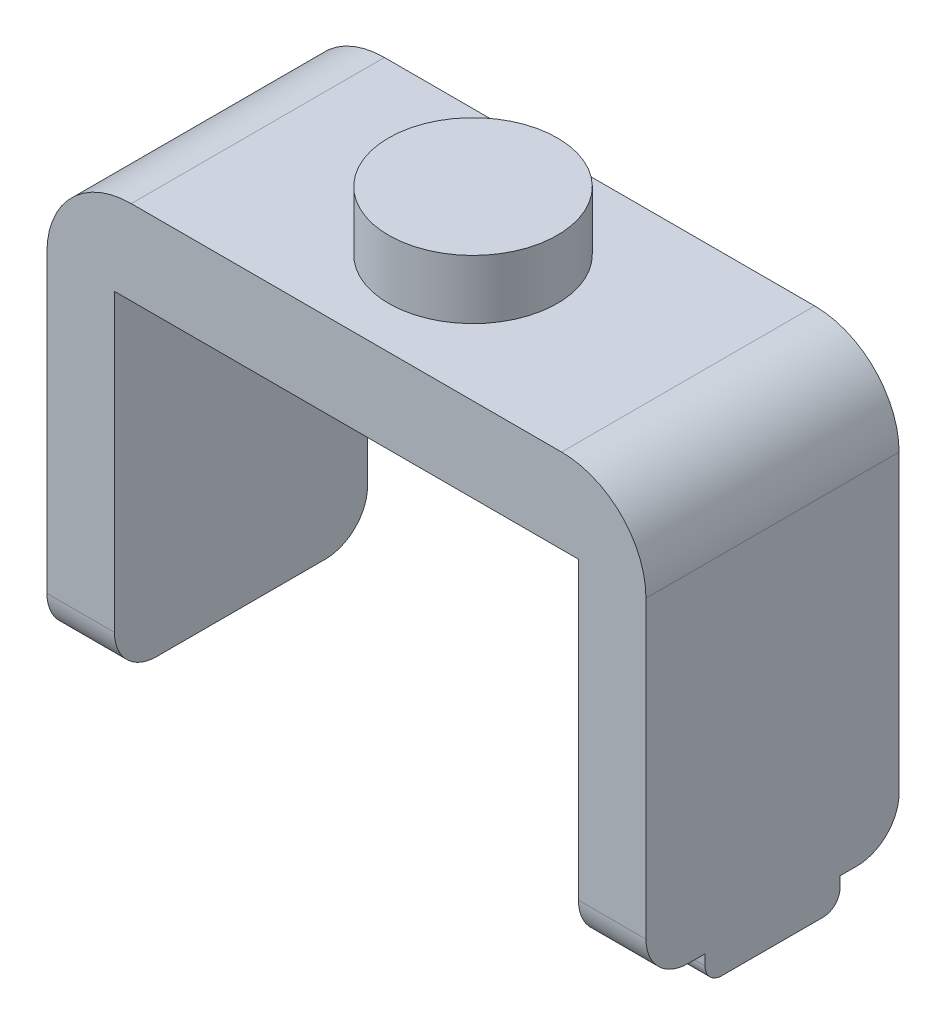
ISO-10303-21;
HEADER;
FILE_DESCRIPTION(('STEP AP214'),'2;1');
FILE_NAME('part.step','',(''),(''),'','','');
FILE_SCHEMA(('AUTOMOTIVE_DESIGN { 1 0 10303 214 1 1 1 1 }'));
ENDSEC;
DATA;
#1=APPLICATION_CONTEXT('core data for automotive mechanical design processes');
#2=APPLICATION_PROTOCOL_DEFINITION('international standard','automotive_design',2000,#1);
#3=PRODUCT_CONTEXT('',#1,'mechanical');
#4=PRODUCT('Part','Part','',(#3));
#5=PRODUCT_RELATED_PRODUCT_CATEGORY('part','',(#4));
#6=PRODUCT_DEFINITION_FORMATION('','',#4);
#7=PRODUCT_DEFINITION_CONTEXT('part definition',#1,'design');
#8=PRODUCT_DEFINITION('design','',#6,#7);
#9=PRODUCT_DEFINITION_SHAPE('','',#8);
#10=(LENGTH_UNIT() NAMED_UNIT(*) SI_UNIT(.MILLI.,.METRE.));
#11=(NAMED_UNIT(*) PLANE_ANGLE_UNIT() SI_UNIT($,.RADIAN.));
#12=(NAMED_UNIT(*) SI_UNIT($,.STERADIAN.) SOLID_ANGLE_UNIT());
#13=UNCERTAINTY_MEASURE_WITH_UNIT(LENGTH_MEASURE(1.E-05),#10,'distance_accuracy_value','');
#14=(GEOMETRIC_REPRESENTATION_CONTEXT(3) GLOBAL_UNCERTAINTY_ASSIGNED_CONTEXT((#13)) GLOBAL_UNIT_ASSIGNED_CONTEXT((#10,
#11,#12)) REPRESENTATION_CONTEXT('',''));
#15=CARTESIAN_POINT('',(0.,0.,0.));
#16=DIRECTION('',(0.,0.,1.));
#17=DIRECTION('',(1.,0.,0.));
#18=AXIS2_PLACEMENT_3D('',#15,#16,#17);
#19=CARTESIAN_POINT('',(-234.34677314212,-20.7036469127959,-30.));
#20=DIRECTION('',(0.,-1.,0.));
#21=DIRECTION('',(0.,0.,-1.));
#22=AXIS2_PLACEMENT_3D('',#19,#20,#21);
#23=PLANE('',#22);
#24=DIRECTION('',(0.,0.,1.));
#25=VECTOR('',#24,1.);
#26=CARTESIAN_POINT('',(-234.34677314212,-20.7036469127959,-30.));
#27=LINE('',#26,#25);
#28=CARTESIAN_POINT('',(-234.34677314212,-20.7036469127959,-7.));
#29=VERTEX_POINT('',#28);
#30=CARTESIAN_POINT('',(-234.34677314212,-20.7036469127959,-5.));
#31=VERTEX_POINT('',#30);
#32=EDGE_CURVE('E200',#29,#31,#27,.T.);
#33=ORIENTED_EDGE('',*,*,#32,.F.);
#34=DIRECTION('',(-1.,0.,0.));
#35=VECTOR('',#34,1.);
#36=CARTESIAN_POINT('',(-226.34677314212,-20.7036469127959,-7.));
#37=LINE('',#36,#35);
#38=CARTESIAN_POINT('',(-226.34677314212,-20.7036469127959,-7.));
#39=VERTEX_POINT('',#38);
#40=EDGE_CURVE('E403',#39,#29,#37,.T.);
#41=ORIENTED_EDGE('',*,*,#40,.F.);
#42=DIRECTION('',(0.,0.,1.));
#43=VECTOR('',#42,1.);
#44=CARTESIAN_POINT('',(-226.34677314212,-20.7036469127959,-30.));
#45=LINE('',#44,#43);
#46=CARTESIAN_POINT('',(-226.34677314212,-20.7036469127959,-5.));
#47=VERTEX_POINT('',#46);
#48=EDGE_CURVE('E191',#39,#47,#45,.T.);
#49=ORIENTED_EDGE('',*,*,#48,.T.);
#50=DIRECTION('',(1.,0.,0.));
#51=VECTOR('',#50,1.);
#52=CARTESIAN_POINT('',(-234.34677314212,-20.7036469127959,-5.));
#53=LINE('',#52,#51);
#54=EDGE_CURVE('E235',#47,#31,#53,.F.);
#55=ORIENTED_EDGE('',*,*,#54,.T.);
#56=EDGE_LOOP('',(#33,#41,#49,#55));
#57=FACE_BOUND('',#56,.T.);
#58=ADVANCED_FACE('F32',(#57),#23,.T.);
#59=CARTESIAN_POINT('',(-226.34677314212,-20.7036469127959,-25.));
#60=VERTEX_POINT('',#59);
#61=CARTESIAN_POINT('',(-226.34677314212,-20.7036469127959,-23.));
#62=VERTEX_POINT('',#61);
#63=EDGE_CURVE('E173',#60,#62,#45,.T.);
#64=ORIENTED_EDGE('',*,*,#63,.T.);
#65=DIRECTION('',(1.,0.,0.));
#66=VECTOR('',#65,1.);
#67=CARTESIAN_POINT('',(-226.34677314212,-20.7036469127959,-23.));
#68=LINE('',#67,#66);
#69=CARTESIAN_POINT('',(-234.34677314212,-20.7036469127959,-23.));
#70=VERTEX_POINT('',#69);
#71=EDGE_CURVE('E178',#70,#62,#68,.T.);
#72=ORIENTED_EDGE('',*,*,#71,.F.);
#73=CARTESIAN_POINT('',(-234.34677314212,-20.7036469127959,-25.));
#74=VERTEX_POINT('',#73);
#75=EDGE_CURVE('E196',#74,#70,#27,.T.);
#76=ORIENTED_EDGE('',*,*,#75,.F.);
#77=DIRECTION('',(1.,0.,0.));
#78=VECTOR('',#77,1.);
#79=CARTESIAN_POINT('',(-226.34677314212,-20.7036469127959,-25.));
#80=LINE('',#79,#78);
#81=EDGE_CURVE('E189',#74,#60,#80,.T.);
#82=ORIENTED_EDGE('',*,*,#81,.T.);
#83=EDGE_LOOP('',(#64,#72,#76,#82));
#84=FACE_BOUND('',#83,.T.);
#85=ADVANCED_FACE('F187',(#84),#23,.T.);
#86=CARTESIAN_POINT('',(-297.34677314212,-20.7036469127959,-30.));
#87=DIRECTION('',(0.,-1.,0.));
#88=DIRECTION('',(0.,0.,-1.));
#89=AXIS2_PLACEMENT_3D('',#86,#87,#88);
#90=PLANE('',#89);
#91=DIRECTION('',(0.,0.,1.));
#92=VECTOR('',#91,1.);
#93=CARTESIAN_POINT('',(-297.34677314212,-20.7036469127959,-30.));
#94=LINE('',#93,#92);
#95=CARTESIAN_POINT('',(-297.34677314212,-20.7036469127959,-25.));
#96=VERTEX_POINT('',#95);
#97=CARTESIAN_POINT('',(-297.34677314212,-20.7036469127959,-5.));
#98=VERTEX_POINT('',#97);
#99=EDGE_CURVE('E190',#96,#98,#94,.T.);
#100=ORIENTED_EDGE('',*,*,#99,.F.);
#101=DIRECTION('',(1.,0.,0.));
#102=VECTOR('',#101,1.);
#103=CARTESIAN_POINT('',(-289.34677314212,-20.7036469127959,-25.));
#104=LINE('',#103,#102);
#105=CARTESIAN_POINT('',(-289.34677314212,-20.7036469127959,-25.));
#106=VERTEX_POINT('',#105);
#107=EDGE_CURVE('E212',#96,#106,#104,.T.);
#108=ORIENTED_EDGE('',*,*,#107,.T.);
#109=DIRECTION('',(0.,0.,1.));
#110=VECTOR('',#109,1.);
#111=CARTESIAN_POINT('',(-289.34677314212,-20.7036469127959,-30.));
#112=LINE('',#111,#110);
#113=CARTESIAN_POINT('',(-289.34677314212,-20.7036469127959,-5.));
#114=VERTEX_POINT('',#113);
#115=EDGE_CURVE('E206',#106,#114,#112,.T.);
#116=ORIENTED_EDGE('',*,*,#115,.T.);
#117=DIRECTION('',(1.,0.,0.));
#118=VECTOR('',#117,1.);
#119=CARTESIAN_POINT('',(-297.34677314212,-20.7036469127959,-5.));
#120=LINE('',#119,#118);
#121=EDGE_CURVE('E210',#114,#98,#120,.F.);
#122=ORIENTED_EDGE('',*,*,#121,.T.);
#123=EDGE_LOOP('',(#100,#108,#116,#122));
#124=FACE_BOUND('',#123,.T.);
#125=ADVANCED_FACE('F303',(#124),#90,.T.);
#126=CARTESIAN_POINT('',(-297.34677314212,29.2963530872041,-30.));
#127=DIRECTION('',(-1.,0.,0.));
#128=DIRECTION('',(0.,0.,1.));
#129=AXIS2_PLACEMENT_3D('',#126,#127,#128);
#130=PLANE('',#129);
#131=DIRECTION('',(0.,-1.,0.));
#132=VECTOR('',#131,1.);
#133=CARTESIAN_POINT('',(-297.34677314212,29.2963530872041,0.));
#134=LINE('',#133,#132);
#135=CARTESIAN_POINT('',(-297.34677314212,19.2963530872041,0.));
#136=VERTEX_POINT('',#135);
#137=CARTESIAN_POINT('',(-297.34677314212,-15.7036469127959,0.));
#138=VERTEX_POINT('',#137);
#139=EDGE_CURVE('E387',#136,#138,#134,.T.);
#140=ORIENTED_EDGE('',*,*,#139,.F.);
#141=DIRECTION('',(0.,0.,1.));
#142=VECTOR('',#141,1.);
#143=CARTESIAN_POINT('',(-297.34677314212,19.2963530872041,-30.));
#144=LINE('',#143,#142);
#145=CARTESIAN_POINT('',(-297.34677314212,19.2963530872041,-30.));
#146=VERTEX_POINT('',#145);
#147=EDGE_CURVE('E257',#136,#146,#144,.F.);
#148=ORIENTED_EDGE('',*,*,#147,.T.);
#149=DIRECTION('',(0.,-1.,0.));
#150=VECTOR('',#149,1.);
#151=CARTESIAN_POINT('',(-297.34677314212,29.2963530872041,-30.));
#152=LINE('',#151,#150);
#153=CARTESIAN_POINT('',(-297.34677314212,-15.7036469127959,-30.));
#154=VERTEX_POINT('',#153);
#155=EDGE_CURVE('E209',#146,#154,#152,.T.);
#156=ORIENTED_EDGE('',*,*,#155,.T.);
#157=CARTESIAN_POINT('',(-297.34677314212,-15.7036469127959,-25.));
#158=DIRECTION('',(-1.,0.,0.));
#159=DIRECTION('',(0.,0.,1.));
#160=AXIS2_PLACEMENT_3D('',#157,#158,#159);
#161=CIRCLE('',#160,5.);
#162=EDGE_CURVE('E227',#154,#96,#161,.T.);
#163=ORIENTED_EDGE('',*,*,#162,.T.);
#164=ORIENTED_EDGE('',*,*,#99,.T.);
#165=CARTESIAN_POINT('',(-297.34677314212,-15.7036469127959,-5.));
#166=DIRECTION('',(-1.,0.,0.));
#167=DIRECTION('',(0.,0.,1.));
#168=AXIS2_PLACEMENT_3D('',#165,#166,#167);
#169=CIRCLE('',#168,5.);
#170=EDGE_CURVE('E224',#98,#138,#169,.T.);
#171=ORIENTED_EDGE('',*,*,#170,.T.);
#172=EDGE_LOOP('',(#140,#148,#156,#163,#164,#171));
#173=FACE_BOUND('',#172,.T.);
#174=ADVANCED_FACE('F321',(#173),#130,.T.);
#175=CARTESIAN_POINT('',(-226.34677314212,29.2963530872041,-30.));
#176=DIRECTION('',(0.,1.,0.));
#177=DIRECTION('',(-1.,0.,0.));
#178=AXIS2_PLACEMENT_3D('',#175,#176,#177);
#179=PLANE('',#178);
#180=CARTESIAN_POINT('',(-261.84677314212,29.2963530872041,-15.));
#181=DIRECTION('',(0.,1.,0.));
#182=DIRECTION('',(-1.,0.,0.));
#183=AXIS2_PLACEMENT_3D('',#180,#181,#182);
#184=CIRCLE('',#183,10.);
#185=CARTESIAN_POINT('',(-271.84677314212,29.2963530872041,-15.));
#186=VERTEX_POINT('',#185);
#187=EDGE_CURVE('E194',#186,#186,#184,.T.);
#188=ORIENTED_EDGE('',*,*,#187,.F.);
#189=EDGE_LOOP('',(#188));
#190=FACE_BOUND('',#189,.T.);
#191=DIRECTION('',(-1.,0.,0.));
#192=VECTOR('',#191,1.);
#193=CARTESIAN_POINT('',(-226.34677314212,29.2963530872041,-30.));
#194=LINE('',#193,#192);
#195=CARTESIAN_POINT('',(-236.34677314212,29.2963530872041,-30.));
#196=VERTEX_POINT('',#195);
#197=CARTESIAN_POINT('',(-287.34677314212,29.2963530872041,-30.));
#198=VERTEX_POINT('',#197);
#199=EDGE_CURVE('E363',#196,#198,#194,.T.);
#200=ORIENTED_EDGE('',*,*,#199,.T.);
#201=DIRECTION('',(0.,0.,1.));
#202=VECTOR('',#201,1.);
#203=CARTESIAN_POINT('',(-287.34677314212,29.2963530872041,-30.));
#204=LINE('',#203,#202);
#205=CARTESIAN_POINT('',(-287.34677314212,29.2963530872041,0.));
#206=VERTEX_POINT('',#205);
#207=EDGE_CURVE('E250',#198,#206,#204,.T.);
#208=ORIENTED_EDGE('',*,*,#207,.T.);
#209=DIRECTION('',(-1.,0.,0.));
#210=VECTOR('',#209,1.);
#211=CARTESIAN_POINT('',(-226.34677314212,29.2963530872041,0.));
#212=LINE('',#211,#210);
#213=CARTESIAN_POINT('',(-236.34677314212,29.2963530872041,0.));
#214=VERTEX_POINT('',#213);
#215=EDGE_CURVE('E385',#214,#206,#212,.T.);
#216=ORIENTED_EDGE('',*,*,#215,.F.);
#217=DIRECTION('',(0.,0.,1.));
#218=VECTOR('',#217,1.);
#219=CARTESIAN_POINT('',(-236.34677314212,29.2963530872041,-30.));
#220=LINE('',#219,#218);
#221=EDGE_CURVE('E248',#214,#196,#220,.F.);
#222=ORIENTED_EDGE('',*,*,#221,.T.);
#223=EDGE_LOOP('',(#200,#208,#216,#222));
#224=FACE_BOUND('',#223,.T.);
#225=ADVANCED_FACE('F419',(#190,#224),#179,.T.);
#226=CARTESIAN_POINT('',(-226.34677314212,-20.7036469127959,-30.));
#227=DIRECTION('',(1.,0.,0.));
#228=DIRECTION('',(0.,0.,-1.));
#229=AXIS2_PLACEMENT_3D('',#226,#227,#228);
#230=PLANE('',#229);
#231=DIRECTION('',(0.,0.,1.));
#232=VECTOR('',#231,1.);
#233=CARTESIAN_POINT('',(-226.34677314212,-23.9536469127959,-23.));
#234=LINE('',#233,#232);
#235=CARTESIAN_POINT('',(-226.34677314212,-23.9536469127959,-21.));
#236=VERTEX_POINT('',#235);
#237=CARTESIAN_POINT('',(-226.34677314212,-23.9536469127959,-9.));
#238=VERTEX_POINT('',#237);
#239=EDGE_CURVE('E184',#236,#238,#234,.T.);
#240=ORIENTED_EDGE('',*,*,#239,.F.);
#241=CARTESIAN_POINT('',(-226.34677314212,-21.9536469127959,-21.));
#242=DIRECTION('',(1.,0.,0.));
#243=DIRECTION('',(0.,0.,-1.));
#244=AXIS2_PLACEMENT_3D('',#241,#242,#243);
#245=CIRCLE('',#244,2.);
#246=CARTESIAN_POINT('',(-226.34677314212,-21.9536469127959,-23.));
#247=VERTEX_POINT('',#246);
#248=EDGE_CURVE('E174',#236,#247,#245,.T.);
#249=ORIENTED_EDGE('',*,*,#248,.T.);
#250=DIRECTION('',(0.,1.,0.));
#251=VECTOR('',#250,1.);
#252=CARTESIAN_POINT('',(-226.34677314212,-41.8421907327942,-23.));
#253=LINE('',#252,#251);
#254=EDGE_CURVE('E168',#247,#62,#253,.T.);
#255=ORIENTED_EDGE('',*,*,#254,.T.);
#256=ORIENTED_EDGE('',*,*,#63,.F.);
#257=CARTESIAN_POINT('',(-226.34677314212,-15.7036469127959,-25.));
#258=DIRECTION('',(1.,0.,0.));
#259=DIRECTION('',(0.,0.,-1.));
#260=AXIS2_PLACEMENT_3D('',#257,#258,#259);
#261=CIRCLE('',#260,5.);
#262=CARTESIAN_POINT('',(-226.34677314212,-15.7036469127959,-30.));
#263=VERTEX_POINT('',#262);
#264=EDGE_CURVE('E242',#60,#263,#261,.T.);
#265=ORIENTED_EDGE('',*,*,#264,.T.);
#266=DIRECTION('',(0.,1.,0.));
#267=VECTOR('',#266,1.);
#268=CARTESIAN_POINT('',(-226.34677314212,-20.7036469127959,-30.));
#269=LINE('',#268,#267);
#270=CARTESIAN_POINT('',(-226.34677314212,19.2963530872041,-30.));
#271=VERTEX_POINT('',#270);
#272=EDGE_CURVE('E360',#263,#271,#269,.T.);
#273=ORIENTED_EDGE('',*,*,#272,.T.);
#274=DIRECTION('',(0.,0.,1.));
#275=VECTOR('',#274,1.);
#276=CARTESIAN_POINT('',(-226.34677314212,19.2963530872041,-30.));
#277=LINE('',#276,#275);
#278=CARTESIAN_POINT('',(-226.34677314212,19.2963530872041,0.));
#279=VERTEX_POINT('',#278);
#280=EDGE_CURVE('E263',#271,#279,#277,.T.);
#281=ORIENTED_EDGE('',*,*,#280,.T.);
#282=DIRECTION('',(0.,1.,0.));
#283=VECTOR('',#282,1.);
#284=CARTESIAN_POINT('',(-226.34677314212,-20.7036469127959,0.));
#285=LINE('',#284,#283);
#286=CARTESIAN_POINT('',(-226.34677314212,-15.7036469127959,0.));
#287=VERTEX_POINT('',#286);
#288=EDGE_CURVE('E383',#287,#279,#285,.T.);
#289=ORIENTED_EDGE('',*,*,#288,.F.);
#290=CARTESIAN_POINT('',(-226.34677314212,-15.7036469127959,-5.));
#291=DIRECTION('',(1.,0.,0.));
#292=DIRECTION('',(0.,0.,-1.));
#293=AXIS2_PLACEMENT_3D('',#290,#291,#292);
#294=CIRCLE('',#293,5.);
#295=EDGE_CURVE('E239',#287,#47,#294,.T.);
#296=ORIENTED_EDGE('',*,*,#295,.T.);
#297=ORIENTED_EDGE('',*,*,#48,.F.);
#298=DIRECTION('',(0.,1.,0.));
#299=VECTOR('',#298,1.);
#300=CARTESIAN_POINT('',(-226.34677314212,-41.8421907327942,-7.));
#301=LINE('',#300,#299);
#302=CARTESIAN_POINT('',(-226.34677314212,-21.9536469127959,-7.));
#303=VERTEX_POINT('',#302);
#304=EDGE_CURVE('E175',#303,#39,#301,.T.);
#305=ORIENTED_EDGE('',*,*,#304,.F.);
#306=CARTESIAN_POINT('',(-226.34677314212,-21.9536469127959,-9.));
#307=DIRECTION('',(1.,0.,0.));
#308=DIRECTION('',(0.,0.,-1.));
#309=AXIS2_PLACEMENT_3D('',#306,#307,#308);
#310=CIRCLE('',#309,2.);
#311=EDGE_CURVE('E272',#303,#238,#310,.T.);
#312=ORIENTED_EDGE('',*,*,#311,.T.);
#313=EDGE_LOOP('',(#240,#249,#255,#256,#265,#273,#281,#289,#296,#297,#305,#312));
#314=FACE_BOUND('',#313,.T.);
#315=ADVANCED_FACE('F171',(#314),#230,.T.);
#316=CARTESIAN_POINT('',(-234.34677314212,19.2963530872041,-30.));
#317=DIRECTION('',(-1.,0.,0.));
#318=DIRECTION('',(0.,0.,1.));
#319=AXIS2_PLACEMENT_3D('',#316,#317,#318);
#320=PLANE('',#319);
#321=DIRECTION('',(0.,1.,0.));
#322=VECTOR('',#321,1.);
#323=CARTESIAN_POINT('',(-234.34677314212,-41.8421907327942,-23.));
#324=LINE('',#323,#322);
#325=CARTESIAN_POINT('',(-234.34677314212,-21.9536469127959,-23.));
#326=VERTEX_POINT('',#325);
#327=EDGE_CURVE('E180',#326,#70,#324,.T.);
#328=ORIENTED_EDGE('',*,*,#327,.F.);
#329=CARTESIAN_POINT('',(-234.34677314212,-21.9536469127959,-21.));
#330=DIRECTION('',(-1.,0.,0.));
#331=DIRECTION('',(0.,0.,1.));
#332=AXIS2_PLACEMENT_3D('',#329,#330,#331);
#333=CIRCLE('',#332,2.);
#334=CARTESIAN_POINT('',(-234.34677314212,-23.9536469127959,-21.));
#335=VERTEX_POINT('',#334);
#336=EDGE_CURVE('E40',#326,#335,#333,.T.);
#337=ORIENTED_EDGE('',*,*,#336,.T.);
#338=DIRECTION('',(0.,0.,-1.));
#339=VECTOR('',#338,1.);
#340=CARTESIAN_POINT('',(-234.34677314212,-23.9536469127959,-23.));
#341=LINE('',#340,#339);
#342=CARTESIAN_POINT('',(-234.34677314212,-23.9536469127959,-9.));
#343=VERTEX_POINT('',#342);
#344=EDGE_CURVE('E279',#343,#335,#341,.T.);
#345=ORIENTED_EDGE('',*,*,#344,.F.);
#346=CARTESIAN_POINT('',(-234.34677314212,-21.9536469127959,-9.));
#347=DIRECTION('',(-1.,0.,0.));
#348=DIRECTION('',(0.,0.,1.));
#349=AXIS2_PLACEMENT_3D('',#346,#347,#348);
#350=CIRCLE('',#349,2.);
#351=CARTESIAN_POINT('',(-234.34677314212,-21.9536469127959,-7.));
#352=VERTEX_POINT('',#351);
#353=EDGE_CURVE('E47',#343,#352,#350,.T.);
#354=ORIENTED_EDGE('',*,*,#353,.T.);
#355=DIRECTION('',(0.,1.,0.));
#356=VECTOR('',#355,1.);
#357=CARTESIAN_POINT('',(-234.34677314212,-41.8421907327942,-7.));
#358=LINE('',#357,#356);
#359=EDGE_CURVE('E401',#352,#29,#358,.T.);
#360=ORIENTED_EDGE('',*,*,#359,.T.);
#361=ORIENTED_EDGE('',*,*,#32,.T.);
#362=CARTESIAN_POINT('',(-234.34677314212,-15.7036469127959,-5.));
#363=DIRECTION('',(-1.,0.,0.));
#364=DIRECTION('',(0.,0.,1.));
#365=AXIS2_PLACEMENT_3D('',#362,#363,#364);
#366=CIRCLE('',#365,5.);
#367=CARTESIAN_POINT('',(-234.34677314212,-15.7036469127959,0.));
#368=VERTEX_POINT('',#367);
#369=EDGE_CURVE('E244',#31,#368,#366,.T.);
#370=ORIENTED_EDGE('',*,*,#369,.T.);
#371=DIRECTION('',(0.,-1.,0.));
#372=VECTOR('',#371,1.);
#373=CARTESIAN_POINT('',(-234.34677314212,19.2963530872041,0.));
#374=LINE('',#373,#372);
#375=CARTESIAN_POINT('',(-234.34677314212,19.2963530872041,0.));
#376=VERTEX_POINT('',#375);
#377=EDGE_CURVE('E380',#376,#368,#374,.T.);
#378=ORIENTED_EDGE('',*,*,#377,.F.);
#379=DIRECTION('',(0.,0.,1.));
#380=VECTOR('',#379,1.);
#381=CARTESIAN_POINT('',(-234.34677314212,19.2963530872041,-30.));
#382=LINE('',#381,#380);
#383=CARTESIAN_POINT('',(-234.34677314212,19.2963530872041,-30.));
#384=VERTEX_POINT('',#383);
#385=EDGE_CURVE('E201',#384,#376,#382,.T.);
#386=ORIENTED_EDGE('',*,*,#385,.F.);
#387=DIRECTION('',(0.,-1.,0.));
#388=VECTOR('',#387,1.);
#389=CARTESIAN_POINT('',(-234.34677314212,19.2963530872041,-30.));
#390=LINE('',#389,#388);
#391=CARTESIAN_POINT('',(-234.34677314212,-15.7036469127959,-30.));
#392=VERTEX_POINT('',#391);
#393=EDGE_CURVE('E366',#384,#392,#390,.T.);
#394=ORIENTED_EDGE('',*,*,#393,.T.);
#395=CARTESIAN_POINT('',(-234.34677314212,-15.7036469127959,-25.));
#396=DIRECTION('',(-1.,0.,0.));
#397=DIRECTION('',(0.,0.,1.));
#398=AXIS2_PLACEMENT_3D('',#395,#396,#397);
#399=CIRCLE('',#398,5.);
#400=EDGE_CURVE('E246',#392,#74,#399,.T.);
#401=ORIENTED_EDGE('',*,*,#400,.T.);
#402=ORIENTED_EDGE('',*,*,#75,.T.);
#403=EDGE_LOOP('',(#328,#337,#345,#354,#360,#361,#370,#378,#386,#394,#401,#402));
#404=FACE_BOUND('',#403,.T.);
#405=ADVANCED_FACE('F278',(#404),#320,.T.);
#406=CARTESIAN_POINT('',(-289.34677314212,19.2963530872041,-30.));
#407=DIRECTION('',(0.,-1.,0.));
#408=DIRECTION('',(0.,0.,-1.));
#409=AXIS2_PLACEMENT_3D('',#406,#407,#408);
#410=PLANE('',#409);
#411=DIRECTION('',(1.,0.,0.));
#412=VECTOR('',#411,1.);
#413=CARTESIAN_POINT('',(-289.34677314212,19.2963530872041,0.));
#414=LINE('',#413,#412);
#415=CARTESIAN_POINT('',(-289.34677314212,19.2963530872041,0.));
#416=VERTEX_POINT('',#415);
#417=EDGE_CURVE('E377',#416,#376,#414,.T.);
#418=ORIENTED_EDGE('',*,*,#417,.F.);
#419=DIRECTION('',(0.,0.,1.));
#420=VECTOR('',#419,1.);
#421=CARTESIAN_POINT('',(-289.34677314212,19.2963530872041,-30.));
#422=LINE('',#421,#420);
#423=CARTESIAN_POINT('',(-289.34677314212,19.2963530872041,-30.));
#424=VERTEX_POINT('',#423);
#425=EDGE_CURVE('E203',#424,#416,#422,.T.);
#426=ORIENTED_EDGE('',*,*,#425,.F.);
#427=DIRECTION('',(1.,0.,0.));
#428=VECTOR('',#427,1.);
#429=CARTESIAN_POINT('',(-289.34677314212,19.2963530872041,-30.));
#430=LINE('',#429,#428);
#431=EDGE_CURVE('E370',#424,#384,#430,.T.);
#432=ORIENTED_EDGE('',*,*,#431,.T.);
#433=ORIENTED_EDGE('',*,*,#385,.T.);
#434=EDGE_LOOP('',(#418,#426,#432,#433));
#435=FACE_BOUND('',#434,.T.);
#436=ADVANCED_FACE('F310',(#435),#410,.T.);
#437=CARTESIAN_POINT('',(-289.34677314212,-20.7036469127959,-30.));
#438=DIRECTION('',(1.,0.,0.));
#439=DIRECTION('',(0.,0.,-1.));
#440=AXIS2_PLACEMENT_3D('',#437,#438,#439);
#441=PLANE('',#440);
#442=ORIENTED_EDGE('',*,*,#115,.F.);
#443=CARTESIAN_POINT('',(-289.34677314212,-15.7036469127959,-25.));
#444=DIRECTION('',(1.,0.,0.));
#445=DIRECTION('',(0.,0.,-1.));
#446=AXIS2_PLACEMENT_3D('',#443,#444,#445);
#447=CIRCLE('',#446,5.);
#448=CARTESIAN_POINT('',(-289.34677314212,-15.7036469127959,-30.));
#449=VERTEX_POINT('',#448);
#450=EDGE_CURVE('E217',#106,#449,#447,.T.);
#451=ORIENTED_EDGE('',*,*,#450,.T.);
#452=DIRECTION('',(0.,1.,0.));
#453=VECTOR('',#452,1.);
#454=CARTESIAN_POINT('',(-289.34677314212,-20.7036469127959,-30.));
#455=LINE('',#454,#453);
#456=EDGE_CURVE('E388',#449,#424,#455,.T.);
#457=ORIENTED_EDGE('',*,*,#456,.T.);
#458=ORIENTED_EDGE('',*,*,#425,.T.);
#459=DIRECTION('',(0.,1.,0.));
#460=VECTOR('',#459,1.);
#461=CARTESIAN_POINT('',(-289.34677314212,-20.7036469127959,0.));
#462=LINE('',#461,#460);
#463=CARTESIAN_POINT('',(-289.34677314212,-15.7036469127959,0.));
#464=VERTEX_POINT('',#463);
#465=EDGE_CURVE('E375',#464,#416,#462,.T.);
#466=ORIENTED_EDGE('',*,*,#465,.F.);
#467=CARTESIAN_POINT('',(-289.34677314212,-15.7036469127959,-5.));
#468=DIRECTION('',(1.,0.,0.));
#469=DIRECTION('',(0.,0.,-1.));
#470=AXIS2_PLACEMENT_3D('',#467,#468,#469);
#471=CIRCLE('',#470,5.);
#472=EDGE_CURVE('E215',#464,#114,#471,.T.);
#473=ORIENTED_EDGE('',*,*,#472,.T.);
#474=EDGE_LOOP('',(#442,#451,#457,#458,#466,#473));
#475=FACE_BOUND('',#474,.T.);
#476=ADVANCED_FACE('F313',(#475),#441,.T.);
#477=CARTESIAN_POINT('',(0.,0.,-30.));
#478=DIRECTION('',(0.,0.,1.));
#479=DIRECTION('',(1.,0.,0.));
#480=AXIS2_PLACEMENT_3D('',#477,#478,#479);
#481=PLANE('',#480);
#482=ORIENTED_EDGE('',*,*,#155,.F.);
#483=CARTESIAN_POINT('',(-287.34677314212,19.2963530872041,-30.));
#484=DIRECTION('',(0.,0.,1.));
#485=DIRECTION('',(1.,0.,0.));
#486=AXIS2_PLACEMENT_3D('',#483,#484,#485);
#487=CIRCLE('',#486,10.);
#488=EDGE_CURVE('E261',#146,#198,#487,.F.);
#489=ORIENTED_EDGE('',*,*,#488,.T.);
#490=ORIENTED_EDGE('',*,*,#199,.F.);
#491=CARTESIAN_POINT('',(-236.34677314212,19.2963530872041,-30.));
#492=DIRECTION('',(0.,0.,1.));
#493=DIRECTION('',(1.,0.,0.));
#494=AXIS2_PLACEMENT_3D('',#491,#492,#493);
#495=CIRCLE('',#494,10.);
#496=EDGE_CURVE('E259',#196,#271,#495,.F.);
#497=ORIENTED_EDGE('',*,*,#496,.T.);
#498=ORIENTED_EDGE('',*,*,#272,.F.);
#499=DIRECTION('',(1.,0.,0.));
#500=VECTOR('',#499,1.);
#501=CARTESIAN_POINT('',(-234.34677314212,-15.7036469127959,-30.));
#502=LINE('',#501,#500);
#503=EDGE_CURVE('E219',#263,#392,#502,.F.);
#504=ORIENTED_EDGE('',*,*,#503,.T.);
#505=ORIENTED_EDGE('',*,*,#393,.F.);
#506=ORIENTED_EDGE('',*,*,#431,.F.);
#507=ORIENTED_EDGE('',*,*,#456,.F.);
#508=DIRECTION('',(1.,0.,0.));
#509=VECTOR('',#508,1.);
#510=CARTESIAN_POINT('',(-297.34677314212,-15.7036469127959,-30.));
#511=LINE('',#510,#509);
#512=EDGE_CURVE('E221',#449,#154,#511,.F.);
#513=ORIENTED_EDGE('',*,*,#512,.T.);
#514=EDGE_LOOP('',(#482,#489,#490,#497,#498,#504,#505,#506,#507,#513));
#515=FACE_BOUND('',#514,.T.);
#516=ADVANCED_FACE('F317',(#515),#481,.F.);
#517=CARTESIAN_POINT('',(0.,0.,0.));
#518=DIRECTION('',(0.,0.,1.));
#519=DIRECTION('',(1.,0.,0.));
#520=AXIS2_PLACEMENT_3D('',#517,#518,#519);
#521=PLANE('',#520);
#522=ORIENTED_EDGE('',*,*,#215,.T.);
#523=CARTESIAN_POINT('',(-287.34677314212,19.2963530872041,0.));
#524=DIRECTION('',(0.,0.,1.));
#525=DIRECTION('',(1.,0.,0.));
#526=AXIS2_PLACEMENT_3D('',#523,#524,#525);
#527=CIRCLE('',#526,10.);
#528=EDGE_CURVE('E255',#206,#136,#527,.T.);
#529=ORIENTED_EDGE('',*,*,#528,.T.);
#530=ORIENTED_EDGE('',*,*,#139,.T.);
#531=DIRECTION('',(1.,0.,0.));
#532=VECTOR('',#531,1.);
#533=CARTESIAN_POINT('',(0.,-15.7036469127959,0.));
#534=LINE('',#533,#532);
#535=EDGE_CURVE('E232',#138,#464,#534,.T.);
#536=ORIENTED_EDGE('',*,*,#535,.T.);
#537=ORIENTED_EDGE('',*,*,#465,.T.);
#538=ORIENTED_EDGE('',*,*,#417,.T.);
#539=ORIENTED_EDGE('',*,*,#377,.T.);
#540=DIRECTION('',(1.,0.,0.));
#541=VECTOR('',#540,1.);
#542=CARTESIAN_POINT('',(0.,-15.7036469127959,0.));
#543=LINE('',#542,#541);
#544=EDGE_CURVE('E229',#368,#287,#543,.T.);
#545=ORIENTED_EDGE('',*,*,#544,.T.);
#546=ORIENTED_EDGE('',*,*,#288,.T.);
#547=CARTESIAN_POINT('',(-236.34677314212,19.2963530872041,0.));
#548=DIRECTION('',(0.,0.,1.));
#549=DIRECTION('',(1.,0.,0.));
#550=AXIS2_PLACEMENT_3D('',#547,#548,#549);
#551=CIRCLE('',#550,10.);
#552=EDGE_CURVE('E253',#279,#214,#551,.T.);
#553=ORIENTED_EDGE('',*,*,#552,.T.);
#554=EDGE_LOOP('',(#522,#529,#530,#536,#537,#538,#539,#545,#546,#553));
#555=FACE_BOUND('',#554,.T.);
#556=ADVANCED_FACE('F415',(#555),#521,.T.);
#557=CARTESIAN_POINT('',(-261.84677314212,36.2963530872041,-15.));
#558=DIRECTION('',(0.,-1.,0.));
#559=DIRECTION('',(1.,0.,0.));
#560=AXIS2_PLACEMENT_3D('',#557,#558,#559);
#561=CYLINDRICAL_SURFACE('',#560,10.);
#562=CARTESIAN_POINT('',(-261.84677314212,36.2963530872041,-15.));
#563=DIRECTION('',(0.,1.,0.));
#564=DIRECTION('',(-1.,0.,0.));
#565=AXIS2_PLACEMENT_3D('',#562,#563,#564);
#566=CIRCLE('',#565,10.);
#567=CARTESIAN_POINT('',(-271.84677314212,36.2963530872041,-15.));
#568=VERTEX_POINT('',#567);
#569=EDGE_CURVE('E286',#568,#568,#566,.T.);
#570=ORIENTED_EDGE('',*,*,#569,.F.);
#571=EDGE_LOOP('',(#570));
#572=FACE_BOUND('',#571,.T.);
#573=ORIENTED_EDGE('',*,*,#187,.T.);
#574=EDGE_LOOP('',(#573));
#575=FACE_BOUND('',#574,.T.);
#576=ADVANCED_FACE('F445',(#572,#575),#561,.T.);
#577=CARTESIAN_POINT('',(-261.84677314212,36.2963530872041,-15.));
#578=DIRECTION('',(0.,1.,0.));
#579=DIRECTION('',(-1.,0.,0.));
#580=AXIS2_PLACEMENT_3D('',#577,#578,#579);
#581=PLANE('',#580);
#582=ORIENTED_EDGE('',*,*,#569,.T.);
#583=EDGE_LOOP('',(#582));
#584=FACE_BOUND('',#583,.T.);
#585=ADVANCED_FACE('F327',(#584),#581,.T.);
#586=CARTESIAN_POINT('',(-297.34677314212,-15.7036469127959,-25.));
#587=DIRECTION('',(-1.,0.,0.));
#588=DIRECTION('',(0.,0.,1.));
#589=AXIS2_PLACEMENT_3D('',#586,#587,#588);
#590=CYLINDRICAL_SURFACE('',#589,5.);
#591=ORIENTED_EDGE('',*,*,#162,.F.);
#592=ORIENTED_EDGE('',*,*,#512,.F.);
#593=ORIENTED_EDGE('',*,*,#450,.F.);
#594=ORIENTED_EDGE('',*,*,#107,.F.);
#595=EDGE_LOOP('',(#591,#592,#593,#594));
#596=FACE_BOUND('',#595,.T.);
#597=ADVANCED_FACE('F323',(#596),#590,.T.);
#598=CARTESIAN_POINT('',(0.,-15.7036469127959,-5.));
#599=DIRECTION('',(1.,0.,0.));
#600=DIRECTION('',(0.,0.,-1.));
#601=AXIS2_PLACEMENT_3D('',#598,#599,#600);
#602=CYLINDRICAL_SURFACE('',#601,5.);
#603=ORIENTED_EDGE('',*,*,#170,.F.);
#604=ORIENTED_EDGE('',*,*,#121,.F.);
#605=ORIENTED_EDGE('',*,*,#472,.F.);
#606=ORIENTED_EDGE('',*,*,#535,.F.);
#607=EDGE_LOOP('',(#603,#604,#605,#606));
#608=FACE_BOUND('',#607,.T.);
#609=ADVANCED_FACE('F326',(#608),#602,.T.);
#610=CARTESIAN_POINT('',(-234.34677314212,-15.7036469127959,-25.));
#611=DIRECTION('',(-1.,0.,0.));
#612=DIRECTION('',(0.,0.,1.));
#613=AXIS2_PLACEMENT_3D('',#610,#611,#612);
#614=CYLINDRICAL_SURFACE('',#613,5.);
#615=ORIENTED_EDGE('',*,*,#400,.F.);
#616=ORIENTED_EDGE('',*,*,#503,.F.);
#617=ORIENTED_EDGE('',*,*,#264,.F.);
#618=ORIENTED_EDGE('',*,*,#81,.F.);
#619=EDGE_LOOP('',(#615,#616,#617,#618));
#620=FACE_BOUND('',#619,.T.);
#621=ADVANCED_FACE('F331',(#620),#614,.T.);
#622=CARTESIAN_POINT('',(0.,-15.7036469127959,-5.));
#623=DIRECTION('',(1.,0.,0.));
#624=DIRECTION('',(0.,0.,-1.));
#625=AXIS2_PLACEMENT_3D('',#622,#623,#624);
#626=CYLINDRICAL_SURFACE('',#625,5.);
#627=ORIENTED_EDGE('',*,*,#369,.F.);
#628=ORIENTED_EDGE('',*,*,#54,.F.);
#629=ORIENTED_EDGE('',*,*,#295,.F.);
#630=ORIENTED_EDGE('',*,*,#544,.F.);
#631=EDGE_LOOP('',(#627,#628,#629,#630));
#632=FACE_BOUND('',#631,.T.);
#633=ADVANCED_FACE('F335',(#632),#626,.T.);
#634=CARTESIAN_POINT('',(-287.34677314212,19.2963530872041,-30.));
#635=DIRECTION('',(0.,0.,1.));
#636=DIRECTION('',(1.,0.,0.));
#637=AXIS2_PLACEMENT_3D('',#634,#635,#636);
#638=CYLINDRICAL_SURFACE('',#637,10.);
#639=ORIENTED_EDGE('',*,*,#488,.F.);
#640=ORIENTED_EDGE('',*,*,#147,.F.);
#641=ORIENTED_EDGE('',*,*,#528,.F.);
#642=ORIENTED_EDGE('',*,*,#207,.F.);
#643=EDGE_LOOP('',(#639,#640,#641,#642));
#644=FACE_BOUND('',#643,.T.);
#645=ADVANCED_FACE('F339',(#644),#638,.T.);
#646=CARTESIAN_POINT('',(-236.34677314212,19.2963530872041,-30.));
#647=DIRECTION('',(0.,0.,1.));
#648=DIRECTION('',(1.,0.,0.));
#649=AXIS2_PLACEMENT_3D('',#646,#647,#648);
#650=CYLINDRICAL_SURFACE('',#649,10.);
#651=ORIENTED_EDGE('',*,*,#496,.F.);
#652=ORIENTED_EDGE('',*,*,#221,.F.);
#653=ORIENTED_EDGE('',*,*,#552,.F.);
#654=ORIENTED_EDGE('',*,*,#280,.F.);
#655=EDGE_LOOP('',(#651,#652,#653,#654));
#656=FACE_BOUND('',#655,.T.);
#657=ADVANCED_FACE('F342',(#656),#650,.T.);
#658=CARTESIAN_POINT('',(-226.34677314212,-41.8421907327942,-7.));
#659=DIRECTION('',(0.,0.,-1.));
#660=DIRECTION('',(-1.,0.,0.));
#661=AXIS2_PLACEMENT_3D('',#658,#659,#660);
#662=PLANE('',#661);
#663=ORIENTED_EDGE('',*,*,#359,.F.);
#664=DIRECTION('',(-1.,0.,0.));
#665=VECTOR('',#664,1.);
#666=CARTESIAN_POINT('',(-226.34677314212,-21.9536469127959,-7.));
#667=LINE('',#666,#665);
#668=EDGE_CURVE('E11',#352,#303,#667,.F.);
#669=ORIENTED_EDGE('',*,*,#668,.T.);
#670=ORIENTED_EDGE('',*,*,#304,.T.);
#671=ORIENTED_EDGE('',*,*,#40,.T.);
#672=EDGE_LOOP('',(#663,#669,#670,#671));
#673=FACE_BOUND('',#672,.T.);
#674=ADVANCED_FACE('F345',(#673),#662,.F.);
#675=CARTESIAN_POINT('',(-226.34677314212,-41.8421907327942,-23.));
#676=DIRECTION('',(0.,0.,1.));
#677=DIRECTION('',(1.,0.,0.));
#678=AXIS2_PLACEMENT_3D('',#675,#676,#677);
#679=PLANE('',#678);
#680=ORIENTED_EDGE('',*,*,#254,.F.);
#681=DIRECTION('',(1.,0.,0.));
#682=VECTOR('',#681,1.);
#683=CARTESIAN_POINT('',(-234.34677314212,-21.9536469127959,-23.));
#684=LINE('',#683,#682);
#685=EDGE_CURVE('E55',#247,#326,#684,.F.);
#686=ORIENTED_EDGE('',*,*,#685,.T.);
#687=ORIENTED_EDGE('',*,*,#327,.T.);
#688=ORIENTED_EDGE('',*,*,#71,.T.);
#689=EDGE_LOOP('',(#680,#686,#687,#688));
#690=FACE_BOUND('',#689,.T.);
#691=ADVANCED_FACE('F179',(#690),#679,.F.);
#692=CARTESIAN_POINT('',(-224.34677314212,-23.9536469127959,-8.82500000000012));
#693=DIRECTION('',(0.,-1.,0.));
#694=DIRECTION('',(-1.,0.,0.));
#695=AXIS2_PLACEMENT_3D('',#692,#693,#694);
#696=PLANE('',#695);
#697=ORIENTED_EDGE('',*,*,#344,.T.);
#698=DIRECTION('',(1.,0.,0.));
#699=VECTOR('',#698,1.);
#700=CARTESIAN_POINT('',(-226.34677314212,-23.9536469127959,-21.));
#701=LINE('',#700,#699);
#702=EDGE_CURVE('E269',#335,#236,#701,.T.);
#703=ORIENTED_EDGE('',*,*,#702,.T.);
#704=ORIENTED_EDGE('',*,*,#239,.T.);
#705=DIRECTION('',(-1.,0.,0.));
#706=VECTOR('',#705,1.);
#707=CARTESIAN_POINT('',(-234.34677314212,-23.9536469127959,-9.));
#708=LINE('',#707,#706);
#709=EDGE_CURVE('E266',#238,#343,#708,.T.);
#710=ORIENTED_EDGE('',*,*,#709,.T.);
#711=EDGE_LOOP('',(#697,#703,#704,#710));
#712=FACE_BOUND('',#711,.T.);
#713=ADVANCED_FACE('F283',(#712),#696,.T.);
#714=CARTESIAN_POINT('',(-224.34677314212,-21.9536469127959,-21.));
#715=DIRECTION('',(-1.,0.,0.));
#716=DIRECTION('',(0.,-1.,0.));
#717=AXIS2_PLACEMENT_3D('',#714,#715,#716);
#718=CYLINDRICAL_SURFACE('',#717,2.);
#719=ORIENTED_EDGE('',*,*,#336,.F.);
#720=ORIENTED_EDGE('',*,*,#685,.F.);
#721=ORIENTED_EDGE('',*,*,#248,.F.);
#722=ORIENTED_EDGE('',*,*,#702,.F.);
#723=EDGE_LOOP('',(#719,#720,#721,#722));
#724=FACE_BOUND('',#723,.T.);
#725=ADVANCED_FACE('F288',(#724),#718,.T.);
#726=CARTESIAN_POINT('',(-224.34677314212,-21.9536469127959,-9.));
#727=DIRECTION('',(1.,0.,0.));
#728=DIRECTION('',(0.,0.,-1.));
#729=AXIS2_PLACEMENT_3D('',#726,#727,#728);
#730=CYLINDRICAL_SURFACE('',#729,2.);
#731=ORIENTED_EDGE('',*,*,#311,.F.);
#732=ORIENTED_EDGE('',*,*,#668,.F.);
#733=ORIENTED_EDGE('',*,*,#353,.F.);
#734=ORIENTED_EDGE('',*,*,#709,.F.);
#735=EDGE_LOOP('',(#731,#732,#733,#734));
#736=FACE_BOUND('',#735,.T.);
#737=ADVANCED_FACE('F34',(#736),#730,.T.);
#738=CLOSED_SHELL('',(#58,#85,#125,#174,#225,#315,#405,#436,#476,#516,#556,#576,#585,#597,#609,
#621,#633,#645,#657,#674,#691,#713,#725,#737));
#739=MANIFOLD_SOLID_BREP('B2',#738);
#740=ADVANCED_BREP_SHAPE_REPRESENTATION('',(#18,#739),#14);
#741=SHAPE_DEFINITION_REPRESENTATION(#9,#740);
ENDSEC;
END-ISO-10303-21;
